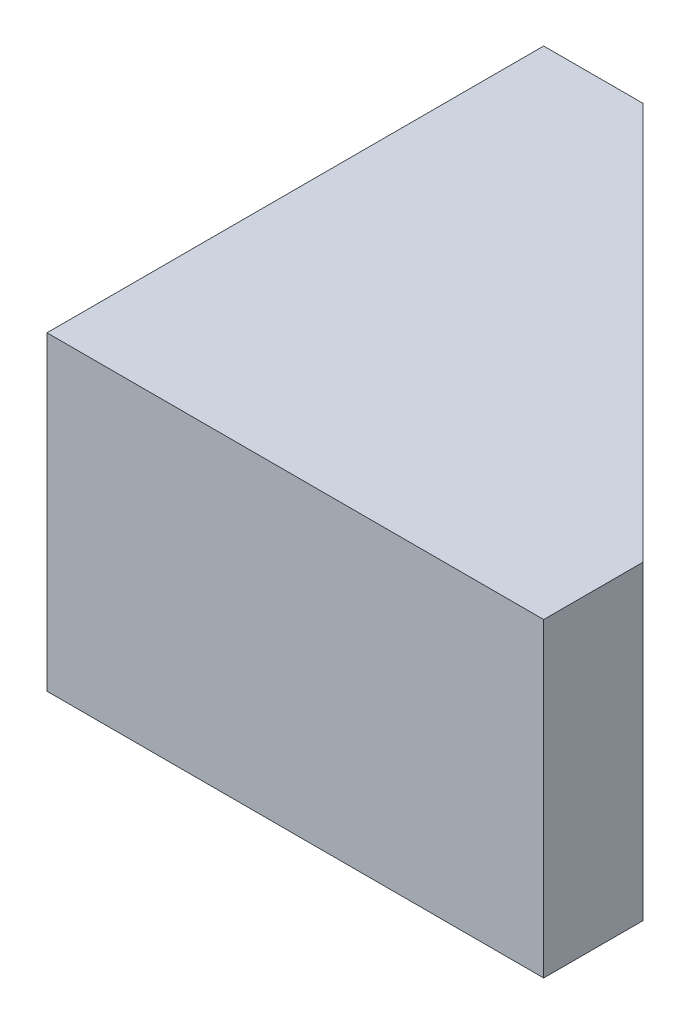
ISO-10303-21;
HEADER;
FILE_DESCRIPTION(('STEP AP214'),'2;1');
FILE_NAME('part.step','',(''),(''),'','','');
FILE_SCHEMA(('AUTOMOTIVE_DESIGN { 1 0 10303 214 1 1 1 1 }'));
ENDSEC;
DATA;
#1=APPLICATION_CONTEXT('core data for automotive mechanical design processes');
#2=APPLICATION_PROTOCOL_DEFINITION('international standard','automotive_design',2000,#1);
#3=PRODUCT_CONTEXT('',#1,'mechanical');
#4=PRODUCT('Part','Part','',(#3));
#5=PRODUCT_RELATED_PRODUCT_CATEGORY('part','',(#4));
#6=PRODUCT_DEFINITION_FORMATION('','',#4);
#7=PRODUCT_DEFINITION_CONTEXT('part definition',#1,'design');
#8=PRODUCT_DEFINITION('design','',#6,#7);
#9=PRODUCT_DEFINITION_SHAPE('','',#8);
#10=(LENGTH_UNIT() NAMED_UNIT(*) SI_UNIT(.MILLI.,.METRE.));
#11=(NAMED_UNIT(*) PLANE_ANGLE_UNIT() SI_UNIT($,.RADIAN.));
#12=(NAMED_UNIT(*) SI_UNIT($,.STERADIAN.) SOLID_ANGLE_UNIT());
#13=UNCERTAINTY_MEASURE_WITH_UNIT(LENGTH_MEASURE(1.E-05),#10,'distance_accuracy_value','');
#14=(GEOMETRIC_REPRESENTATION_CONTEXT(3) GLOBAL_UNCERTAINTY_ASSIGNED_CONTEXT((#13)) GLOBAL_UNIT_ASSIGNED_CONTEXT((#10,
#11,#12)) REPRESENTATION_CONTEXT('',''));
#15=CARTESIAN_POINT('',(0.,0.,0.));
#16=DIRECTION('',(0.,0.,1.));
#17=DIRECTION('',(1.,0.,0.));
#18=AXIS2_PLACEMENT_3D('',#15,#16,#17);
#19=CARTESIAN_POINT('',(0.,25.,-8.));
#20=DIRECTION('',(-1.,0.,0.));
#21=DIRECTION('',(0.,0.,1.));
#22=AXIS2_PLACEMENT_3D('',#19,#20,#21);
#23=PLANE('',#22);
#24=DIRECTION('',(0.,0.,-1.));
#25=VECTOR('',#24,1.);
#26=CARTESIAN_POINT('',(0.,0.,-8.));
#27=LINE('',#26,#25);
#28=CARTESIAN_POINT('',(0.,0.,0.));
#29=VERTEX_POINT('',#28);
#30=CARTESIAN_POINT('',(0.,0.,-8.));
#31=VERTEX_POINT('',#30);
#32=EDGE_CURVE('E113',#29,#31,#27,.T.);
#33=ORIENTED_EDGE('',*,*,#32,.T.);
#34=DIRECTION('',(0.,-1.,0.));
#35=VECTOR('',#34,1.);
#36=CARTESIAN_POINT('',(0.,25.,-8.));
#37=LINE('',#36,#35);
#38=CARTESIAN_POINT('',(0.,25.,-8.));
#39=VERTEX_POINT('',#38);
#40=EDGE_CURVE('E11',#39,#31,#37,.T.);
#41=ORIENTED_EDGE('',*,*,#40,.F.);
#42=DIRECTION('',(0.,0.,-1.));
#43=VECTOR('',#42,1.);
#44=CARTESIAN_POINT('',(0.,25.,-8.));
#45=LINE('',#44,#43);
#46=CARTESIAN_POINT('',(0.,25.,0.));
#47=VERTEX_POINT('',#46);
#48=EDGE_CURVE('E121',#47,#39,#45,.T.);
#49=ORIENTED_EDGE('',*,*,#48,.F.);
#50=DIRECTION('',(0.,-1.,0.));
#51=VECTOR('',#50,1.);
#52=CARTESIAN_POINT('',(0.,25.,0.));
#53=LINE('',#52,#51);
#54=EDGE_CURVE('E109',#47,#29,#53,.T.);
#55=ORIENTED_EDGE('',*,*,#54,.T.);
#56=EDGE_LOOP('',(#33,#41,#49,#55));
#57=FACE_BOUND('',#56,.T.);
#58=ADVANCED_FACE('F39',(#57),#23,.F.);
#59=CARTESIAN_POINT('',(-32.,25.,-40.));
#60=DIRECTION('',(-0.707106781186548,0.,0.707106781186548));
#61=DIRECTION('',(0.707106781186548,0.,0.707106781186548));
#62=AXIS2_PLACEMENT_3D('',#59,#60,#61);
#63=PLANE('',#62);
#64=DIRECTION('',(-0.707106781186548,0.,-0.707106781186548));
#65=VECTOR('',#64,1.);
#66=CARTESIAN_POINT('',(-32.,0.,-40.));
#67=LINE('',#66,#65);
#68=CARTESIAN_POINT('',(-32.,0.,-40.));
#69=VERTEX_POINT('',#68);
#70=EDGE_CURVE('E116',#31,#69,#67,.T.);
#71=ORIENTED_EDGE('',*,*,#70,.T.);
#72=DIRECTION('',(0.,-1.,0.));
#73=VECTOR('',#72,1.);
#74=CARTESIAN_POINT('',(-32.,25.,-40.));
#75=LINE('',#74,#73);
#76=CARTESIAN_POINT('',(-32.,25.,-40.));
#77=VERTEX_POINT('',#76);
#78=EDGE_CURVE('E47',#77,#69,#75,.T.);
#79=ORIENTED_EDGE('',*,*,#78,.F.);
#80=DIRECTION('',(-0.707106781186548,0.,-0.707106781186548));
#81=VECTOR('',#80,1.);
#82=CARTESIAN_POINT('',(-32.,25.,-40.));
#83=LINE('',#82,#81);
#84=EDGE_CURVE('E89',#39,#77,#83,.T.);
#85=ORIENTED_EDGE('',*,*,#84,.F.);
#86=ORIENTED_EDGE('',*,*,#40,.T.);
#87=EDGE_LOOP('',(#71,#79,#85,#86));
#88=FACE_BOUND('',#87,.T.);
#89=ADVANCED_FACE('F140',(#88),#63,.F.);
#90=CARTESIAN_POINT('',(-40.,25.,-40.));
#91=DIRECTION('',(0.,0.,1.));
#92=DIRECTION('',(1.,0.,0.));
#93=AXIS2_PLACEMENT_3D('',#90,#91,#92);
#94=PLANE('',#93);
#95=DIRECTION('',(-1.,0.,0.));
#96=VECTOR('',#95,1.);
#97=CARTESIAN_POINT('',(-40.,0.,-40.));
#98=LINE('',#97,#96);
#99=CARTESIAN_POINT('',(-40.,0.,-40.));
#100=VERTEX_POINT('',#99);
#101=EDGE_CURVE('E104',#69,#100,#98,.T.);
#102=ORIENTED_EDGE('',*,*,#101,.T.);
#103=DIRECTION('',(0.,-1.,0.));
#104=VECTOR('',#103,1.);
#105=CARTESIAN_POINT('',(-40.,25.,-40.));
#106=LINE('',#105,#104);
#107=CARTESIAN_POINT('',(-40.,25.,-40.));
#108=VERTEX_POINT('',#107);
#109=EDGE_CURVE('E101',#108,#100,#106,.T.);
#110=ORIENTED_EDGE('',*,*,#109,.F.);
#111=DIRECTION('',(-1.,0.,0.));
#112=VECTOR('',#111,1.);
#113=CARTESIAN_POINT('',(-40.,25.,-40.));
#114=LINE('',#113,#112);
#115=EDGE_CURVE('E93',#77,#108,#114,.T.);
#116=ORIENTED_EDGE('',*,*,#115,.F.);
#117=ORIENTED_EDGE('',*,*,#78,.T.);
#118=EDGE_LOOP('',(#102,#110,#116,#117));
#119=FACE_BOUND('',#118,.T.);
#120=ADVANCED_FACE('F102',(#119),#94,.F.);
#121=CARTESIAN_POINT('',(-40.,25.,0.));
#122=DIRECTION('',(1.,0.,0.));
#123=DIRECTION('',(0.,0.,-1.));
#124=AXIS2_PLACEMENT_3D('',#121,#122,#123);
#125=PLANE('',#124);
#126=DIRECTION('',(0.,0.,1.));
#127=VECTOR('',#126,1.);
#128=CARTESIAN_POINT('',(-40.,0.,0.));
#129=LINE('',#128,#127);
#130=CARTESIAN_POINT('',(-40.,0.,0.));
#131=VERTEX_POINT('',#130);
#132=EDGE_CURVE('E75',#100,#131,#129,.T.);
#133=ORIENTED_EDGE('',*,*,#132,.T.);
#134=DIRECTION('',(0.,-1.,0.));
#135=VECTOR('',#134,1.);
#136=CARTESIAN_POINT('',(-40.,25.,0.));
#137=LINE('',#136,#135);
#138=CARTESIAN_POINT('',(-40.,25.,0.));
#139=VERTEX_POINT('',#138);
#140=EDGE_CURVE('E105',#139,#131,#137,.T.);
#141=ORIENTED_EDGE('',*,*,#140,.F.);
#142=DIRECTION('',(0.,0.,1.));
#143=VECTOR('',#142,1.);
#144=CARTESIAN_POINT('',(-40.,25.,0.));
#145=LINE('',#144,#143);
#146=EDGE_CURVE('E97',#108,#139,#145,.T.);
#147=ORIENTED_EDGE('',*,*,#146,.F.);
#148=ORIENTED_EDGE('',*,*,#109,.T.);
#149=EDGE_LOOP('',(#133,#141,#147,#148));
#150=FACE_BOUND('',#149,.T.);
#151=ADVANCED_FACE('F107',(#150),#125,.F.);
#152=CARTESIAN_POINT('',(0.,25.,0.));
#153=DIRECTION('',(0.,0.,-1.));
#154=DIRECTION('',(-1.,0.,0.));
#155=AXIS2_PLACEMENT_3D('',#152,#153,#154);
#156=PLANE('',#155);
#157=DIRECTION('',(1.,0.,0.));
#158=VECTOR('',#157,1.);
#159=CARTESIAN_POINT('',(0.,0.,0.));
#160=LINE('',#159,#158);
#161=EDGE_CURVE('E81',#131,#29,#160,.T.);
#162=ORIENTED_EDGE('',*,*,#161,.T.);
#163=ORIENTED_EDGE('',*,*,#54,.F.);
#164=DIRECTION('',(1.,0.,0.));
#165=VECTOR('',#164,1.);
#166=CARTESIAN_POINT('',(0.,25.,0.));
#167=LINE('',#166,#165);
#168=EDGE_CURVE('E55',#139,#47,#167,.T.);
#169=ORIENTED_EDGE('',*,*,#168,.F.);
#170=ORIENTED_EDGE('',*,*,#140,.T.);
#171=EDGE_LOOP('',(#162,#163,#169,#170));
#172=FACE_BOUND('',#171,.T.);
#173=ADVANCED_FACE('F129',(#172),#156,.F.);
#174=CARTESIAN_POINT('',(0.,25.,0.));
#175=DIRECTION('',(0.,-1.,0.));
#176=DIRECTION('',(0.,0.,-1.));
#177=AXIS2_PLACEMENT_3D('',#174,#175,#176);
#178=PLANE('',#177);
#179=ORIENTED_EDGE('',*,*,#48,.T.);
#180=ORIENTED_EDGE('',*,*,#84,.T.);
#181=ORIENTED_EDGE('',*,*,#115,.T.);
#182=ORIENTED_EDGE('',*,*,#146,.T.);
#183=ORIENTED_EDGE('',*,*,#168,.T.);
#184=EDGE_LOOP('',(#179,#180,#181,#182,#183));
#185=FACE_BOUND('',#184,.T.);
#186=ADVANCED_FACE('F95',(#185),#178,.F.);
#187=CARTESIAN_POINT('',(0.,0.,0.));
#188=DIRECTION('',(0.,-1.,0.));
#189=DIRECTION('',(0.,0.,-1.));
#190=AXIS2_PLACEMENT_3D('',#187,#188,#189);
#191=PLANE('',#190);
#192=ORIENTED_EDGE('',*,*,#32,.F.);
#193=ORIENTED_EDGE('',*,*,#161,.F.);
#194=ORIENTED_EDGE('',*,*,#132,.F.);
#195=ORIENTED_EDGE('',*,*,#101,.F.);
#196=ORIENTED_EDGE('',*,*,#70,.F.);
#197=EDGE_LOOP('',(#192,#193,#194,#195,#196));
#198=FACE_BOUND('',#197,.T.);
#199=ADVANCED_FACE('F125',(#198),#191,.T.);
#200=CLOSED_SHELL('',(#58,#89,#120,#151,#173,#186,#199));
#201=MANIFOLD_SOLID_BREP('B2',#200);
#202=ADVANCED_BREP_SHAPE_REPRESENTATION('',(#18,#201),#14);
#203=SHAPE_DEFINITION_REPRESENTATION(#9,#202);
ENDSEC;
END-ISO-10303-21;
